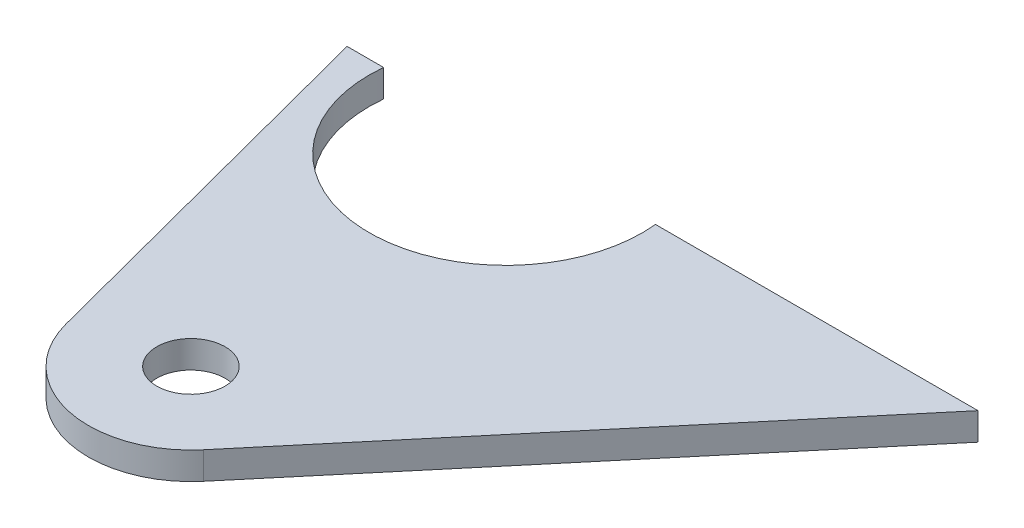
ISO-10303-21;
HEADER;
FILE_DESCRIPTION(('STEP AP214'),'2;1');
FILE_NAME('part.step','',(''),(''),'','','');
FILE_SCHEMA(('AUTOMOTIVE_DESIGN { 1 0 10303 214 1 1 1 1 }'));
ENDSEC;
DATA;
#1=APPLICATION_CONTEXT('core data for automotive mechanical design processes');
#2=APPLICATION_PROTOCOL_DEFINITION('international standard','automotive_design',2000,#1);
#3=PRODUCT_CONTEXT('',#1,'mechanical');
#4=PRODUCT('Part','Part','',(#3));
#5=PRODUCT_RELATED_PRODUCT_CATEGORY('part','',(#4));
#6=PRODUCT_DEFINITION_FORMATION('','',#4);
#7=PRODUCT_DEFINITION_CONTEXT('part definition',#1,'design');
#8=PRODUCT_DEFINITION('design','',#6,#7);
#9=PRODUCT_DEFINITION_SHAPE('','',#8);
#10=(LENGTH_UNIT() NAMED_UNIT(*) SI_UNIT(.MILLI.,.METRE.));
#11=(NAMED_UNIT(*) PLANE_ANGLE_UNIT() SI_UNIT($,.RADIAN.));
#12=(NAMED_UNIT(*) SI_UNIT($,.STERADIAN.) SOLID_ANGLE_UNIT());
#13=UNCERTAINTY_MEASURE_WITH_UNIT(LENGTH_MEASURE(1.E-05),#10,'distance_accuracy_value','');
#14=(GEOMETRIC_REPRESENTATION_CONTEXT(3) GLOBAL_UNCERTAINTY_ASSIGNED_CONTEXT((#13)) GLOBAL_UNIT_ASSIGNED_CONTEXT((#10,
#11,#12)) REPRESENTATION_CONTEXT('',''));
#15=CARTESIAN_POINT('',(0.,0.,0.));
#16=DIRECTION('',(0.,0.,1.));
#17=DIRECTION('',(1.,0.,0.));
#18=AXIS2_PLACEMENT_3D('',#15,#16,#17);
#19=CARTESIAN_POINT('',(-1653.47201946472,331.47,146.05));
#20=DIRECTION('',(0.,1.,0.));
#21=DIRECTION('',(-1.,0.,0.));
#22=AXIS2_PLACEMENT_3D('',#19,#20,#21);
#23=CYLINDRICAL_SURFACE('',#22,12.7);
#24=CARTESIAN_POINT('',(-1653.47201946472,334.01,146.05));
#25=DIRECTION('',(0.,-1.,0.));
#26=DIRECTION('',(1.,0.,0.));
#27=AXIS2_PLACEMENT_3D('',#24,#25,#26);
#28=CIRCLE('',#27,12.7);
#29=CARTESIAN_POINT('',(-1640.83567901347,334.01,144.78));
#30=VERTEX_POINT('',#29);
#31=CARTESIAN_POINT('',(-1666.10835991597,334.01,144.78));
#32=VERTEX_POINT('',#31);
#33=EDGE_CURVE('E122',#30,#32,#28,.T.);
#34=ORIENTED_EDGE('',*,*,#33,.F.);
#35=DIRECTION('',(0.,1.,0.));
#36=VECTOR('',#35,1.);
#37=CARTESIAN_POINT('',(-1640.83567901347,331.47,144.78));
#38=LINE('',#37,#36);
#39=CARTESIAN_POINT('',(-1640.83567901347,331.47,144.78));
#40=VERTEX_POINT('',#39);
#41=EDGE_CURVE('E11',#40,#30,#38,.T.);
#42=ORIENTED_EDGE('',*,*,#41,.F.);
#43=CARTESIAN_POINT('',(-1653.47201946472,331.47,146.05));
#44=DIRECTION('',(0.,-1.,0.));
#45=DIRECTION('',(1.,0.,0.));
#46=AXIS2_PLACEMENT_3D('',#43,#44,#45);
#47=CIRCLE('',#46,12.7);
#48=CARTESIAN_POINT('',(-1666.10835991597,331.47,144.78));
#49=VERTEX_POINT('',#48);
#50=EDGE_CURVE('E137',#40,#49,#47,.T.);
#51=ORIENTED_EDGE('',*,*,#50,.T.);
#52=DIRECTION('',(0.,1.,0.));
#53=VECTOR('',#52,1.);
#54=CARTESIAN_POINT('',(-1666.10835991597,331.47,144.78));
#55=LINE('',#54,#53);
#56=EDGE_CURVE('E80',#49,#32,#55,.T.);
#57=ORIENTED_EDGE('',*,*,#56,.T.);
#58=EDGE_LOOP('',(#34,#42,#51,#57));
#59=FACE_BOUND('',#58,.T.);
#60=ADVANCED_FACE('F36',(#59),#23,.F.);
#61=CARTESIAN_POINT('',(1.99840144432528E-12,331.47,144.779999999999));
#62=DIRECTION('',(0.,0.,1.));
#63=DIRECTION('',(0.,-1.,0.));
#64=AXIS2_PLACEMENT_3D('',#61,#62,#63);
#65=PLANE('',#64);
#66=DIRECTION('',(1.,0.,0.));
#67=VECTOR('',#66,1.);
#68=CARTESIAN_POINT('',(1.99840144432528E-12,334.01,144.779999999999));
#69=LINE('',#68,#67);
#70=CARTESIAN_POINT('',(-1610.85892574764,334.01,144.78));
#71=VERTEX_POINT('',#70);
#72=EDGE_CURVE('E125',#30,#71,#69,.T.);
#73=ORIENTED_EDGE('',*,*,#72,.T.);
#74=DIRECTION('',(0.,1.,0.));
#75=VECTOR('',#74,1.);
#76=CARTESIAN_POINT('',(-1610.85892574764,331.47,144.78));
#77=LINE('',#76,#75);
#78=CARTESIAN_POINT('',(-1610.85892574764,331.47,144.78));
#79=VERTEX_POINT('',#78);
#80=EDGE_CURVE('E44',#79,#71,#77,.T.);
#81=ORIENTED_EDGE('',*,*,#80,.F.);
#82=DIRECTION('',(1.,0.,0.));
#83=VECTOR('',#82,1.);
#84=CARTESIAN_POINT('',(1.99840144432528E-12,331.47,144.779999999999));
#85=LINE('',#84,#83);
#86=EDGE_CURVE('E151',#40,#79,#85,.T.);
#87=ORIENTED_EDGE('',*,*,#86,.F.);
#88=ORIENTED_EDGE('',*,*,#41,.T.);
#89=EDGE_LOOP('',(#73,#81,#87,#88));
#90=FACE_BOUND('',#89,.T.);
#91=ADVANCED_FACE('F154',(#90),#65,.F.);
#92=CARTESIAN_POINT('',(-874.000588100554,331.47,-733.373571123905));
#93=DIRECTION('',(-0.766044443118978,0.,-0.642787609686541));
#94=DIRECTION('',(-0.642787609686541,0.,0.766044443118978));
#95=AXIS2_PLACEMENT_3D('',#92,#93,#94);
#96=PLANE('',#95);
#97=DIRECTION('',(-0.642787609686541,0.,0.766044443118978));
#98=VECTOR('',#97,1.);
#99=CARTESIAN_POINT('',(-874.000588100554,334.01,-733.373571123905));
#100=LINE('',#99,#98);
#101=CARTESIAN_POINT('',(-1643.70342667929,334.01,183.922551982264));
#102=VERTEX_POINT('',#101);
#103=EDGE_CURVE('E127',#71,#102,#100,.T.);
#104=ORIENTED_EDGE('',*,*,#103,.T.);
#105=DIRECTION('',(0.,1.,0.));
#106=VECTOR('',#105,1.);
#107=CARTESIAN_POINT('',(-1643.70342667929,331.47,183.922551982264));
#108=LINE('',#107,#106);
#109=CARTESIAN_POINT('',(-1643.70342667929,331.47,183.922551982264));
#110=VERTEX_POINT('',#109);
#111=EDGE_CURVE('E112',#110,#102,#108,.T.);
#112=ORIENTED_EDGE('',*,*,#111,.F.);
#113=DIRECTION('',(-0.642787609686541,0.,0.766044443118978));
#114=VECTOR('',#113,1.);
#115=CARTESIAN_POINT('',(-874.000588100554,331.47,-733.373571123905));
#116=LINE('',#115,#114);
#117=EDGE_CURVE('E99',#79,#110,#116,.T.);
#118=ORIENTED_EDGE('',*,*,#117,.F.);
#119=ORIENTED_EDGE('',*,*,#80,.T.);
#120=EDGE_LOOP('',(#104,#112,#118,#119));
#121=FACE_BOUND('',#120,.T.);
#122=ADVANCED_FACE('F144',(#121),#96,.F.);
#123=CARTESIAN_POINT('',(-1651.,331.47,177.8));
#124=DIRECTION('',(0.,1.,0.));
#125=DIRECTION('',(-1.,0.,0.));
#126=AXIS2_PLACEMENT_3D('',#123,#124,#125);
#127=CYLINDRICAL_SURFACE('',#126,9.52499999999971);
#128=CARTESIAN_POINT('',(-1651.,334.01,177.8));
#129=DIRECTION('',(0.,-1.,0.));
#130=DIRECTION('',(1.,0.,0.));
#131=AXIS2_PLACEMENT_3D('',#128,#129,#130);
#132=CIRCLE('',#131,9.52499999999971);
#133=CARTESIAN_POINT('',(-1660.2138375721,334.01,180.21470954669));
#134=VERTEX_POINT('',#133);
#135=EDGE_CURVE('E108',#102,#134,#132,.T.);
#136=ORIENTED_EDGE('',*,*,#135,.T.);
#137=DIRECTION('',(0.,1.,0.));
#138=VECTOR('',#137,1.);
#139=CARTESIAN_POINT('',(-1660.2138375721,331.47,180.21470954669));
#140=LINE('',#139,#138);
#141=CARTESIAN_POINT('',(-1660.2138375721,331.47,180.21470954669));
#142=VERTEX_POINT('',#141);
#143=EDGE_CURVE('E105',#142,#134,#140,.T.);
#144=ORIENTED_EDGE('',*,*,#143,.F.);
#145=CARTESIAN_POINT('',(-1651.,331.47,177.8));
#146=DIRECTION('',(0.,-1.,0.));
#147=DIRECTION('',(1.,0.,0.));
#148=AXIS2_PLACEMENT_3D('',#145,#146,#147);
#149=CIRCLE('',#148,9.52499999999971);
#150=EDGE_CURVE('E92',#110,#142,#149,.T.);
#151=ORIENTED_EDGE('',*,*,#150,.F.);
#152=ORIENTED_EDGE('',*,*,#111,.T.);
#153=EDGE_LOOP('',(#136,#144,#151,#152));
#154=FACE_BOUND('',#153,.T.);
#155=ADVANCED_FACE('F106',(#154),#127,.T.);
#156=CARTESIAN_POINT('',(-1597.70822025966,331.47,418.71817927056));
#157=DIRECTION('',(-0.967332028567398,0.,0.253512813300798));
#158=DIRECTION('',(0.253512813300798,0.,0.967332028567398));
#159=AXIS2_PLACEMENT_3D('',#156,#157,#158);
#160=PLANE('',#159);
#161=DIRECTION('',(0.253512813300798,0.,0.967332028567397));
#162=VECTOR('',#161,1.);
#163=CARTESIAN_POINT('',(-1597.70822025966,334.01,418.71817927056));
#164=LINE('',#163,#162);
#165=CARTESIAN_POINT('',(-1669.50036240576,334.01,144.78));
#166=VERTEX_POINT('',#165);
#167=EDGE_CURVE('E130',#166,#134,#164,.T.);
#168=ORIENTED_EDGE('',*,*,#167,.F.);
#169=DIRECTION('',(0.,1.,0.));
#170=VECTOR('',#169,1.);
#171=CARTESIAN_POINT('',(-1669.50036240576,331.47,144.78));
#172=LINE('',#171,#170);
#173=CARTESIAN_POINT('',(-1669.50036240576,331.47,144.78));
#174=VERTEX_POINT('',#173);
#175=EDGE_CURVE('E73',#174,#166,#172,.T.);
#176=ORIENTED_EDGE('',*,*,#175,.F.);
#177=DIRECTION('',(0.253512813300798,0.,0.967332028567397));
#178=VECTOR('',#177,1.);
#179=CARTESIAN_POINT('',(-1597.70822025966,331.47,418.71817927056));
#180=LINE('',#179,#178);
#181=EDGE_CURVE('E97',#174,#142,#180,.T.);
#182=ORIENTED_EDGE('',*,*,#181,.T.);
#183=ORIENTED_EDGE('',*,*,#143,.T.);
#184=EDGE_LOOP('',(#168,#176,#182,#183));
#185=FACE_BOUND('',#184,.T.);
#186=ADVANCED_FACE('F114',(#185),#160,.T.);
#187=CARTESIAN_POINT('',(1.99840144432528E-12,331.47,144.779999999999));
#188=DIRECTION('',(0.,0.,1.));
#189=DIRECTION('',(0.,-1.,0.));
#190=AXIS2_PLACEMENT_3D('',#187,#188,#189);
#191=PLANE('',#190);
#192=DIRECTION('',(1.,0.,0.));
#193=VECTOR('',#192,1.);
#194=CARTESIAN_POINT('',(1.99840144432528E-12,334.01,144.779999999999));
#195=LINE('',#194,#193);
#196=EDGE_CURVE('E132',#166,#32,#195,.T.);
#197=ORIENTED_EDGE('',*,*,#196,.T.);
#198=ORIENTED_EDGE('',*,*,#56,.F.);
#199=DIRECTION('',(1.,0.,0.));
#200=VECTOR('',#199,1.);
#201=CARTESIAN_POINT('',(1.99840144432528E-12,331.47,144.779999999999));
#202=LINE('',#201,#200);
#203=EDGE_CURVE('E52',#174,#49,#202,.T.);
#204=ORIENTED_EDGE('',*,*,#203,.F.);
#205=ORIENTED_EDGE('',*,*,#175,.T.);
#206=EDGE_LOOP('',(#197,#198,#204,#205));
#207=FACE_BOUND('',#206,.T.);
#208=ADVANCED_FACE('F150',(#207),#191,.F.);
#209=CARTESIAN_POINT('',(-1651.,331.47,177.8));
#210=DIRECTION('',(0.,1.,0.));
#211=DIRECTION('',(-1.,0.,0.));
#212=AXIS2_PLACEMENT_3D('',#209,#210,#211);
#213=CYLINDRICAL_SURFACE('',#212,3.17499999999986);
#214=CARTESIAN_POINT('',(-1651.,331.47,177.8));
#215=DIRECTION('',(0.,-1.,0.));
#216=DIRECTION('',(1.,0.,0.));
#217=AXIS2_PLACEMENT_3D('',#214,#215,#216);
#218=CIRCLE('',#217,3.17499999999986);
#219=CARTESIAN_POINT('',(-1647.825,331.47,177.8));
#220=VERTEX_POINT('',#219);
#221=EDGE_CURVE('E116',#220,#220,#218,.T.);
#222=ORIENTED_EDGE('',*,*,#221,.T.);
#223=EDGE_LOOP('',(#222));
#224=FACE_BOUND('',#223,.T.);
#225=CARTESIAN_POINT('',(-1651.,334.01,177.8));
#226=DIRECTION('',(0.,-1.,0.));
#227=DIRECTION('',(1.,0.,0.));
#228=AXIS2_PLACEMENT_3D('',#225,#226,#227);
#229=CIRCLE('',#228,3.17499999999986);
#230=CARTESIAN_POINT('',(-1647.825,334.01,177.8));
#231=VERTEX_POINT('',#230);
#232=EDGE_CURVE('E134',#231,#231,#229,.T.);
#233=ORIENTED_EDGE('',*,*,#232,.F.);
#234=EDGE_LOOP('',(#233));
#235=FACE_BOUND('',#234,.T.);
#236=ADVANCED_FACE('F168',(#224,#235),#213,.F.);
#237=CARTESIAN_POINT('',(1.77635683940025E-12,331.47,-4.71844785465692E-13));
#238=DIRECTION('',(0.,-1.,0.));
#239=DIRECTION('',(1.,0.,0.));
#240=AXIS2_PLACEMENT_3D('',#237,#238,#239);
#241=PLANE('',#240);
#242=ORIENTED_EDGE('',*,*,#50,.F.);
#243=ORIENTED_EDGE('',*,*,#86,.T.);
#244=ORIENTED_EDGE('',*,*,#117,.T.);
#245=ORIENTED_EDGE('',*,*,#150,.T.);
#246=ORIENTED_EDGE('',*,*,#181,.F.);
#247=ORIENTED_EDGE('',*,*,#203,.T.);
#248=EDGE_LOOP('',(#242,#243,#244,#245,#246,#247));
#249=FACE_BOUND('',#248,.T.);
#250=ORIENTED_EDGE('',*,*,#221,.F.);
#251=EDGE_LOOP('',(#250));
#252=FACE_BOUND('',#251,.T.);
#253=ADVANCED_FACE('F94',(#249,#252),#241,.T.);
#254=CARTESIAN_POINT('',(1.77635683940025E-12,334.01,-4.71844785465692E-13));
#255=DIRECTION('',(0.,-1.,0.));
#256=DIRECTION('',(1.,0.,0.));
#257=AXIS2_PLACEMENT_3D('',#254,#255,#256);
#258=PLANE('',#257);
#259=ORIENTED_EDGE('',*,*,#33,.T.);
#260=ORIENTED_EDGE('',*,*,#196,.F.);
#261=ORIENTED_EDGE('',*,*,#167,.T.);
#262=ORIENTED_EDGE('',*,*,#135,.F.);
#263=ORIENTED_EDGE('',*,*,#103,.F.);
#264=ORIENTED_EDGE('',*,*,#72,.F.);
#265=EDGE_LOOP('',(#259,#260,#261,#262,#263,#264));
#266=FACE_BOUND('',#265,.T.);
#267=ORIENTED_EDGE('',*,*,#232,.T.);
#268=EDGE_LOOP('',(#267));
#269=FACE_BOUND('',#268,.T.);
#270=ADVANCED_FACE('F148',(#266,#269),#258,.F.);
#271=CLOSED_SHELL('',(#60,#91,#122,#155,#186,#208,#236,#253,#270));
#272=MANIFOLD_SOLID_BREP('B2',#271);
#273=ADVANCED_BREP_SHAPE_REPRESENTATION('',(#18,#272),#14);
#274=SHAPE_DEFINITION_REPRESENTATION(#9,#273);
ENDSEC;
END-ISO-10303-21;
